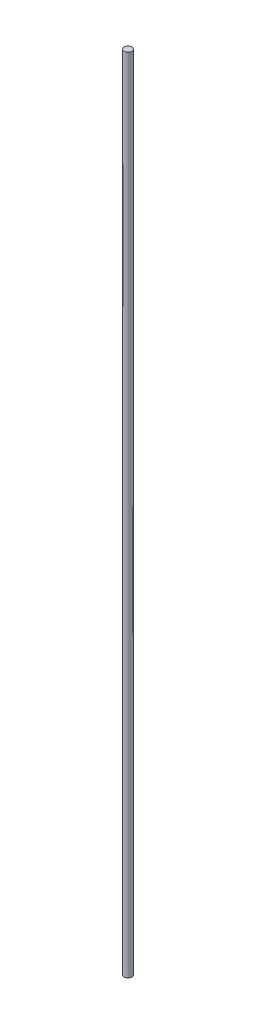
ISO-10303-21;
HEADER;
FILE_DESCRIPTION(('STEP AP214'),'2;1');
FILE_NAME('part.step','',(''),(''),'','','');
FILE_SCHEMA(('AUTOMOTIVE_DESIGN { 1 0 10303 214 1 1 1 1 }'));
ENDSEC;
DATA;
#1=APPLICATION_CONTEXT('core data for automotive mechanical design processes');
#2=APPLICATION_PROTOCOL_DEFINITION('international standard','automotive_design',2000,#1);
#3=PRODUCT_CONTEXT('',#1,'mechanical');
#4=PRODUCT('Part','Part','',(#3));
#5=PRODUCT_RELATED_PRODUCT_CATEGORY('part','',(#4));
#6=PRODUCT_DEFINITION_FORMATION('','',#4);
#7=PRODUCT_DEFINITION_CONTEXT('part definition',#1,'design');
#8=PRODUCT_DEFINITION('design','',#6,#7);
#9=PRODUCT_DEFINITION_SHAPE('','',#8);
#10=(LENGTH_UNIT() NAMED_UNIT(*) SI_UNIT(.MILLI.,.METRE.));
#11=(NAMED_UNIT(*) PLANE_ANGLE_UNIT() SI_UNIT($,.RADIAN.));
#12=(NAMED_UNIT(*) SI_UNIT($,.STERADIAN.) SOLID_ANGLE_UNIT());
#13=UNCERTAINTY_MEASURE_WITH_UNIT(LENGTH_MEASURE(1.E-05),#10,'distance_accuracy_value','');
#14=(GEOMETRIC_REPRESENTATION_CONTEXT(3) GLOBAL_UNCERTAINTY_ASSIGNED_CONTEXT((#13)) GLOBAL_UNIT_ASSIGNED_CONTEXT((#10,
#11,#12)) REPRESENTATION_CONTEXT('',''));
#15=CARTESIAN_POINT('',(0.,0.,0.));
#16=DIRECTION('',(0.,0.,1.));
#17=DIRECTION('',(1.,0.,0.));
#18=AXIS2_PLACEMENT_3D('',#15,#16,#17);
#19=CARTESIAN_POINT('',(0.793749999999999,1.5875,0.));
#20=DIRECTION('',(0.,-1.,0.));
#21=DIRECTION('',(1.,0.,0.));
#22=AXIS2_PLACEMENT_3D('',#19,#20,#21);
#23=PLANE('',#22);
#24=CARTESIAN_POINT('',(0.,1.5875,0.));
#25=DIRECTION('',(0.,-1.,0.));
#26=DIRECTION('',(1.,0.,0.));
#27=AXIS2_PLACEMENT_3D('',#24,#25,#26);
#28=CIRCLE('',#27,0.79375);
#29=CARTESIAN_POINT('',(0.793749999999999,1.5875,0.));
#30=VERTEX_POINT('',#29);
#31=EDGE_CURVE('E54',#30,#30,#28,.T.);
#32=ORIENTED_EDGE('',*,*,#31,.T.);
#33=EDGE_LOOP('',(#32));
#34=FACE_BOUND('',#33,.T.);
#35=ADVANCED_FACE('F37',(#34),#23,.T.);
#36=CARTESIAN_POINT('',(0.,500.,0.));
#37=DIRECTION('',(0.,1.,0.));
#38=DIRECTION('',(-1.,0.,0.));
#39=AXIS2_PLACEMENT_3D('',#36,#37,#38);
#40=PLANE('',#39);
#41=CARTESIAN_POINT('',(0.,500.,0.));
#42=DIRECTION('',(0.,-1.,0.));
#43=DIRECTION('',(1.,0.,0.));
#44=AXIS2_PLACEMENT_3D('',#41,#42,#43);
#45=CIRCLE('',#44,2.38125);
#46=CARTESIAN_POINT('',(2.38125,500.,0.));
#47=VERTEX_POINT('',#46);
#48=EDGE_CURVE('E10',#47,#47,#45,.T.);
#49=ORIENTED_EDGE('',*,*,#48,.F.);
#50=EDGE_LOOP('',(#49));
#51=FACE_BOUND('',#50,.T.);
#52=ADVANCED_FACE('F73',(#51),#40,.T.);
#53=CARTESIAN_POINT('',(0.,1.5875,0.));
#54=DIRECTION('',(0.,-1.,0.));
#55=DIRECTION('',(1.,0.,0.));
#56=AXIS2_PLACEMENT_3D('',#53,#54,#55);
#57=CYLINDRICAL_SURFACE('',#56,2.38125);
#58=ORIENTED_EDGE('',*,*,#48,.T.);
#59=EDGE_LOOP('',(#58));
#60=FACE_BOUND('',#59,.T.);
#61=CARTESIAN_POINT('',(0.,0.,0.));
#62=DIRECTION('',(0.,-1.,0.));
#63=DIRECTION('',(1.,0.,0.));
#64=AXIS2_PLACEMENT_3D('',#61,#62,#63);
#65=CIRCLE('',#64,2.38125);
#66=CARTESIAN_POINT('',(2.38125,0.,0.));
#67=VERTEX_POINT('',#66);
#68=EDGE_CURVE('E44',#67,#67,#65,.T.);
#69=ORIENTED_EDGE('',*,*,#68,.F.);
#70=EDGE_LOOP('',(#69));
#71=FACE_BOUND('',#70,.T.);
#72=ADVANCED_FACE('F70',(#60,#71),#57,.T.);
#73=CARTESIAN_POINT('',(2.38125,0.,0.));
#74=DIRECTION('',(0.,-1.,0.));
#75=DIRECTION('',(1.,0.,0.));
#76=AXIS2_PLACEMENT_3D('',#73,#74,#75);
#77=PLANE('',#76);
#78=ORIENTED_EDGE('',*,*,#68,.T.);
#79=EDGE_LOOP('',(#78));
#80=FACE_BOUND('',#79,.T.);
#81=CARTESIAN_POINT('',(0.,0.,0.));
#82=DIRECTION('',(0.,-1.,0.));
#83=DIRECTION('',(1.,0.,0.));
#84=AXIS2_PLACEMENT_3D('',#81,#82,#83);
#85=CIRCLE('',#84,0.79375);
#86=CARTESIAN_POINT('',(0.79375,0.,0.));
#87=VERTEX_POINT('',#86);
#88=EDGE_CURVE('E49',#87,#87,#85,.T.);
#89=ORIENTED_EDGE('',*,*,#88,.F.);
#90=EDGE_LOOP('',(#89));
#91=FACE_BOUND('',#90,.T.);
#92=ADVANCED_FACE('F64',(#80,#91),#77,.T.);
#93=CARTESIAN_POINT('',(0.,1.5875,0.));
#94=DIRECTION('',(0.,-1.,0.));
#95=DIRECTION('',(1.,0.,0.));
#96=AXIS2_PLACEMENT_3D('',#93,#94,#95);
#97=CYLINDRICAL_SURFACE('',#96,0.79375);
#98=ORIENTED_EDGE('',*,*,#88,.T.);
#99=EDGE_LOOP('',(#98));
#100=FACE_BOUND('',#99,.T.);
#101=ORIENTED_EDGE('',*,*,#31,.F.);
#102=EDGE_LOOP('',(#101));
#103=FACE_BOUND('',#102,.T.);
#104=ADVANCED_FACE('F62',(#100,#103),#97,.F.);
#105=CLOSED_SHELL('',(#35,#52,#72,#92,#104));
#106=MANIFOLD_SOLID_BREP('B2',#105);
#107=ADVANCED_BREP_SHAPE_REPRESENTATION('',(#18,#106),#14);
#108=SHAPE_DEFINITION_REPRESENTATION(#9,#107);
ENDSEC;
END-ISO-10303-21;
